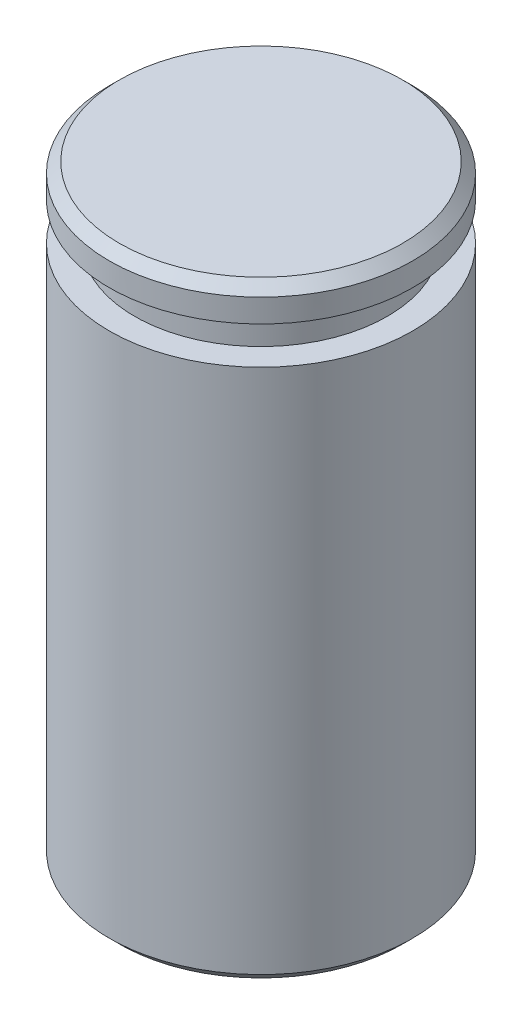
ISO-10303-21;
HEADER;
FILE_DESCRIPTION(('STEP AP214'),'2;1');
FILE_NAME('part.step','',(''),(''),'','','');
FILE_SCHEMA(('AUTOMOTIVE_DESIGN { 1 0 10303 214 1 1 1 1 }'));
ENDSEC;
DATA;
#1=APPLICATION_CONTEXT('core data for automotive mechanical design processes');
#2=APPLICATION_PROTOCOL_DEFINITION('international standard','automotive_design',2000,#1);
#3=PRODUCT_CONTEXT('',#1,'mechanical');
#4=PRODUCT('Part','Part','',(#3));
#5=PRODUCT_RELATED_PRODUCT_CATEGORY('part','',(#4));
#6=PRODUCT_DEFINITION_FORMATION('','',#4);
#7=PRODUCT_DEFINITION_CONTEXT('part definition',#1,'design');
#8=PRODUCT_DEFINITION('design','',#6,#7);
#9=PRODUCT_DEFINITION_SHAPE('','',#8);
#10=(LENGTH_UNIT() NAMED_UNIT(*) SI_UNIT(.MILLI.,.METRE.));
#11=(NAMED_UNIT(*) PLANE_ANGLE_UNIT() SI_UNIT($,.RADIAN.));
#12=(NAMED_UNIT(*) SI_UNIT($,.STERADIAN.) SOLID_ANGLE_UNIT());
#13=UNCERTAINTY_MEASURE_WITH_UNIT(LENGTH_MEASURE(1.E-05),#10,'distance_accuracy_value','');
#14=(GEOMETRIC_REPRESENTATION_CONTEXT(3) GLOBAL_UNCERTAINTY_ASSIGNED_CONTEXT((#13)) GLOBAL_UNIT_ASSIGNED_CONTEXT((#10,
#11,#12)) REPRESENTATION_CONTEXT('',''));
#15=CARTESIAN_POINT('',(0.,0.,0.));
#16=DIRECTION('',(0.,0.,1.));
#17=DIRECTION('',(1.,0.,0.));
#18=AXIS2_PLACEMENT_3D('',#15,#16,#17);
#19=CARTESIAN_POINT('',(0.,0.,0.));
#20=DIRECTION('',(0.,-1.,0.));
#21=DIRECTION('',(0.,0.,-1.));
#22=AXIS2_PLACEMENT_3D('',#19,#20,#21);
#23=CYLINDRICAL_SURFACE('',#22,3.);
#24=CARTESIAN_POINT('',(0.,0.200000000000002,0.));
#25=DIRECTION('',(0.,-1.,0.));
#26=DIRECTION('',(0.,0.,-1.));
#27=AXIS2_PLACEMENT_3D('',#24,#25,#26);
#28=CIRCLE('',#27,3.);
#29=CARTESIAN_POINT('',(0.,0.200000000000002,-3.));
#30=VERTEX_POINT('',#29);
#31=EDGE_CURVE('E10',#30,#30,#28,.F.);
#32=ORIENTED_EDGE('',*,*,#31,.T.);
#33=EDGE_LOOP('',(#32));
#34=FACE_BOUND('',#33,.T.);
#35=CARTESIAN_POINT('',(0.,10.6,0.));
#36=DIRECTION('',(0.,1.,0.));
#37=DIRECTION('',(0.,0.,1.));
#38=AXIS2_PLACEMENT_3D('',#35,#36,#37);
#39=CIRCLE('',#38,3.);
#40=CARTESIAN_POINT('',(0.,10.6,3.));
#41=VERTEX_POINT('',#40);
#42=EDGE_CURVE('E50',#41,#41,#39,.F.);
#43=ORIENTED_EDGE('',*,*,#42,.T.);
#44=EDGE_LOOP('',(#43));
#45=FACE_BOUND('',#44,.T.);
#46=ADVANCED_FACE('F30',(#34,#45),#23,.T.);
#47=CARTESIAN_POINT('',(0.,0.,0.));
#48=DIRECTION('',(0.,-1.,0.));
#49=DIRECTION('',(0.,0.,-1.));
#50=AXIS2_PLACEMENT_3D('',#47,#48,#49);
#51=PLANE('',#50);
#52=CARTESIAN_POINT('',(0.,0.,0.));
#53=DIRECTION('',(0.,-1.,0.));
#54=DIRECTION('',(0.,0.,-1.));
#55=AXIS2_PLACEMENT_3D('',#52,#53,#54);
#56=CIRCLE('',#55,2.8);
#57=CARTESIAN_POINT('',(0.,0.,-2.8));
#58=VERTEX_POINT('',#57);
#59=EDGE_CURVE('E37',#58,#58,#56,.T.);
#60=ORIENTED_EDGE('',*,*,#59,.T.);
#61=EDGE_LOOP('',(#60));
#62=FACE_BOUND('',#61,.T.);
#63=ADVANCED_FACE('F83',(#62),#51,.T.);
#64=CARTESIAN_POINT('',(0.,50.0288087537218,0.));
#65=DIRECTION('',(0.,-1.,0.));
#66=DIRECTION('',(0.,0.,-1.));
#67=AXIS2_PLACEMENT_3D('',#64,#65,#66);
#68=CYLINDRICAL_SURFACE('',#67,2.5);
#69=CARTESIAN_POINT('',(0.,11.34,0.));
#70=DIRECTION('',(0.,-1.,0.));
#71=DIRECTION('',(0.,0.,-1.));
#72=AXIS2_PLACEMENT_3D('',#69,#70,#71);
#73=CIRCLE('',#72,2.5);
#74=CARTESIAN_POINT('',(0.,11.34,-2.5));
#75=VERTEX_POINT('',#74);
#76=EDGE_CURVE('E59',#75,#75,#73,.T.);
#77=ORIENTED_EDGE('',*,*,#76,.T.);
#78=EDGE_LOOP('',(#77));
#79=FACE_BOUND('',#78,.T.);
#80=CARTESIAN_POINT('',(0.,10.6,0.));
#81=DIRECTION('',(0.,-1.,0.));
#82=DIRECTION('',(0.,0.,-1.));
#83=AXIS2_PLACEMENT_3D('',#80,#81,#82);
#84=CIRCLE('',#83,2.5);
#85=CARTESIAN_POINT('',(0.,10.6,-2.5));
#86=VERTEX_POINT('',#85);
#87=EDGE_CURVE('E56',#86,#86,#84,.T.);
#88=ORIENTED_EDGE('',*,*,#87,.F.);
#89=EDGE_LOOP('',(#88));
#90=FACE_BOUND('',#89,.T.);
#91=ADVANCED_FACE('F63',(#79,#90),#68,.T.);
#92=CARTESIAN_POINT('',(0.,10.6,-4.55000000000001));
#93=DIRECTION('',(0.,1.,0.));
#94=DIRECTION('',(0.,0.,1.));
#95=AXIS2_PLACEMENT_3D('',#92,#93,#94);
#96=PLANE('',#95);
#97=ORIENTED_EDGE('',*,*,#42,.F.);
#98=EDGE_LOOP('',(#97));
#99=FACE_BOUND('',#98,.T.);
#100=ORIENTED_EDGE('',*,*,#87,.T.);
#101=EDGE_LOOP('',(#100));
#102=FACE_BOUND('',#101,.T.);
#103=ADVANCED_FACE('F69',(#99,#102),#96,.T.);
#104=CARTESIAN_POINT('',(0.,11.34,-4.55000000000001));
#105=DIRECTION('',(0.,-1.,0.));
#106=DIRECTION('',(0.,0.,-1.));
#107=AXIS2_PLACEMENT_3D('',#104,#105,#106);
#108=PLANE('',#107);
#109=CARTESIAN_POINT('',(0.,11.34,0.));
#110=DIRECTION('',(0.,-1.,0.));
#111=DIRECTION('',(0.,0.,-1.));
#112=AXIS2_PLACEMENT_3D('',#109,#110,#111);
#113=CIRCLE('',#112,3.);
#114=CARTESIAN_POINT('',(0.,11.34,-3.));
#115=VERTEX_POINT('',#114);
#116=EDGE_CURVE('E53',#115,#115,#113,.F.);
#117=ORIENTED_EDGE('',*,*,#116,.F.);
#118=EDGE_LOOP('',(#117));
#119=FACE_BOUND('',#118,.T.);
#120=ORIENTED_EDGE('',*,*,#76,.F.);
#121=EDGE_LOOP('',(#120));
#122=FACE_BOUND('',#121,.T.);
#123=ADVANCED_FACE('F66',(#119,#122),#108,.T.);
#124=CARTESIAN_POINT('',(0.,12.,0.));
#125=DIRECTION('',(0.,1.,0.));
#126=DIRECTION('',(0.,0.,1.));
#127=AXIS2_PLACEMENT_3D('',#124,#125,#126);
#128=PLANE('',#127);
#129=CARTESIAN_POINT('',(0.,12.,0.));
#130=DIRECTION('',(0.,1.,0.));
#131=DIRECTION('',(0.,0.,1.));
#132=AXIS2_PLACEMENT_3D('',#129,#130,#131);
#133=CIRCLE('',#132,2.8);
#134=CARTESIAN_POINT('',(0.,12.,2.8));
#135=VERTEX_POINT('',#134);
#136=EDGE_CURVE('E41',#135,#135,#133,.T.);
#137=ORIENTED_EDGE('',*,*,#136,.T.);
#138=EDGE_LOOP('',(#137));
#139=FACE_BOUND('',#138,.T.);
#140=ADVANCED_FACE('F68',(#139),#128,.T.);
#141=CARTESIAN_POINT('',(0.,11.8,0.));
#142=DIRECTION('',(0.,1.,0.));
#143=DIRECTION('',(0.,0.,1.));
#144=AXIS2_PLACEMENT_3D('',#141,#142,#143);
#145=CIRCLE('',#144,3.);
#146=CARTESIAN_POINT('',(0.,11.8,3.));
#147=VERTEX_POINT('',#146);
#148=EDGE_CURVE('E45',#147,#147,#145,.F.);
#149=ORIENTED_EDGE('',*,*,#148,.T.);
#150=EDGE_LOOP('',(#149));
#151=FACE_BOUND('',#150,.T.);
#152=ORIENTED_EDGE('',*,*,#116,.T.);
#153=EDGE_LOOP('',(#152));
#154=FACE_BOUND('',#153,.T.);
#155=ADVANCED_FACE('F76',(#151,#154),#23,.T.);
#156=CARTESIAN_POINT('',(0.,11.8,0.));
#157=DIRECTION('',(0.,-1.,0.));
#158=DIRECTION('',(0.,0.,-1.));
#159=AXIS2_PLACEMENT_3D('',#156,#157,#158);
#160=CONICAL_SURFACE('',#159,3.,0.785398163397447);
#161=ORIENTED_EDGE('',*,*,#136,.F.);
#162=EDGE_LOOP('',(#161));
#163=FACE_BOUND('',#162,.T.);
#164=ORIENTED_EDGE('',*,*,#148,.F.);
#165=EDGE_LOOP('',(#164));
#166=FACE_BOUND('',#165,.T.);
#167=ADVANCED_FACE('F91',(#163,#166),#160,.T.);
#168=CARTESIAN_POINT('',(0.,0.,0.));
#169=DIRECTION('',(0.,1.,0.));
#170=DIRECTION('',(0.,0.,1.));
#171=AXIS2_PLACEMENT_3D('',#168,#169,#170);
#172=CONICAL_SURFACE('',#171,2.8,0.785398163397443);
#173=ORIENTED_EDGE('',*,*,#31,.F.);
#174=EDGE_LOOP('',(#173));
#175=FACE_BOUND('',#174,.T.);
#176=ORIENTED_EDGE('',*,*,#59,.F.);
#177=EDGE_LOOP('',(#176));
#178=FACE_BOUND('',#177,.T.);
#179=ADVANCED_FACE('F32',(#175,#178),#172,.T.);
#180=CLOSED_SHELL('',(#46,#63,#91,#103,#123,#140,#155,#167,#179));
#181=MANIFOLD_SOLID_BREP('B2',#180);
#182=ADVANCED_BREP_SHAPE_REPRESENTATION('',(#18,#181),#14);
#183=SHAPE_DEFINITION_REPRESENTATION(#9,#182);
ENDSEC;
END-ISO-10303-21;
